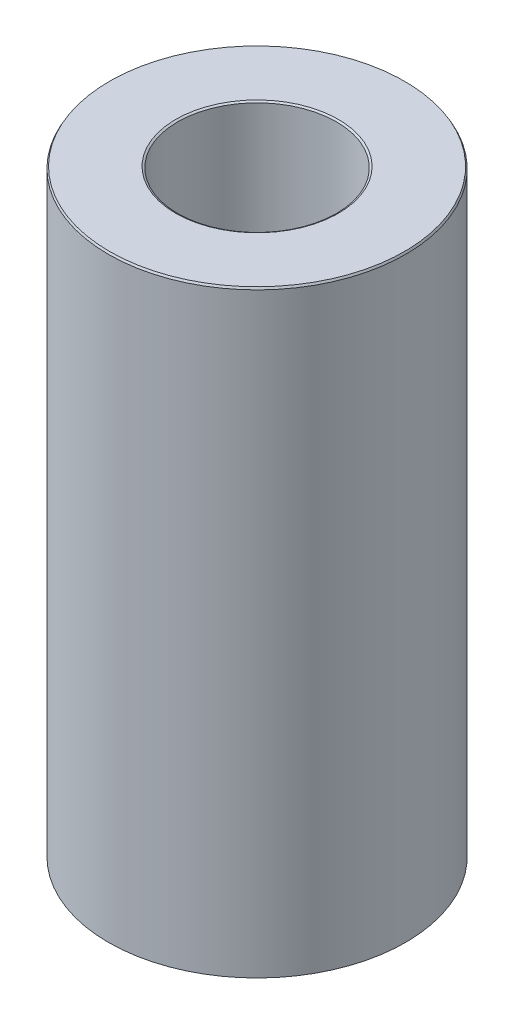
ISO-10303-21;
HEADER;
FILE_DESCRIPTION(('STEP AP214'),'2;1');
FILE_NAME('part.step','',(''),(''),'','','');
FILE_SCHEMA(('AUTOMOTIVE_DESIGN { 1 0 10303 214 1 1 1 1 }'));
ENDSEC;
DATA;
#1=APPLICATION_CONTEXT('core data for automotive mechanical design processes');
#2=APPLICATION_PROTOCOL_DEFINITION('international standard','automotive_design',2000,#1);
#3=PRODUCT_CONTEXT('',#1,'mechanical');
#4=PRODUCT('Part','Part','',(#3));
#5=PRODUCT_RELATED_PRODUCT_CATEGORY('part','',(#4));
#6=PRODUCT_DEFINITION_FORMATION('','',#4);
#7=PRODUCT_DEFINITION_CONTEXT('part definition',#1,'design');
#8=PRODUCT_DEFINITION('design','',#6,#7);
#9=PRODUCT_DEFINITION_SHAPE('','',#8);
#10=(LENGTH_UNIT() NAMED_UNIT(*) SI_UNIT(.MILLI.,.METRE.));
#11=(NAMED_UNIT(*) PLANE_ANGLE_UNIT() SI_UNIT($,.RADIAN.));
#12=(NAMED_UNIT(*) SI_UNIT($,.STERADIAN.) SOLID_ANGLE_UNIT());
#13=UNCERTAINTY_MEASURE_WITH_UNIT(LENGTH_MEASURE(1.E-05),#10,'distance_accuracy_value','');
#14=(GEOMETRIC_REPRESENTATION_CONTEXT(3) GLOBAL_UNCERTAINTY_ASSIGNED_CONTEXT((#13)) GLOBAL_UNIT_ASSIGNED_CONTEXT((#10,
#11,#12)) REPRESENTATION_CONTEXT('',''));
#15=CARTESIAN_POINT('',(0.,0.,0.));
#16=DIRECTION('',(0.,0.,1.));
#17=DIRECTION('',(1.,0.,0.));
#18=AXIS2_PLACEMENT_3D('',#15,#16,#17);
#19=CARTESIAN_POINT('',(0.,100.771122174254,0.));
#20=DIRECTION('',(0.,-1.,0.));
#21=DIRECTION('',(0.,0.,-1.));
#22=AXIS2_PLACEMENT_3D('',#19,#20,#21);
#23=CYLINDRICAL_SURFACE('',#22,25.);
#24=CARTESIAN_POINT('',(0.,0.188308871382908,0.));
#25=DIRECTION('',(0.,1.,0.));
#26=DIRECTION('',(0.,0.,1.));
#27=AXIS2_PLACEMENT_3D('',#24,#25,#26);
#28=CIRCLE('',#27,25.);
#29=CARTESIAN_POINT('',(0.,0.188308871382908,25.));
#30=VERTEX_POINT('',#29);
#31=EDGE_CURVE('E10',#30,#30,#28,.T.);
#32=ORIENTED_EDGE('',*,*,#31,.T.);
#33=EDGE_LOOP('',(#32));
#34=FACE_BOUND('',#33,.T.);
#35=CARTESIAN_POINT('',(0.,100.444961641503,0.));
#36=DIRECTION('',(0.,1.,0.));
#37=DIRECTION('',(0.,0.,1.));
#38=AXIS2_PLACEMENT_3D('',#35,#36,#37);
#39=CIRCLE('',#38,25.);
#40=CARTESIAN_POINT('',(0.,100.444961641503,25.));
#41=VERTEX_POINT('',#40);
#42=EDGE_CURVE('E50',#41,#41,#39,.F.);
#43=ORIENTED_EDGE('',*,*,#42,.T.);
#44=EDGE_LOOP('',(#43));
#45=FACE_BOUND('',#44,.T.);
#46=ADVANCED_FACE('F39',(#34,#45),#23,.T.);
#47=CARTESIAN_POINT('',(0.,100.771122174254,0.));
#48=DIRECTION('',(0.,1.,0.));
#49=DIRECTION('',(0.,0.,1.));
#50=AXIS2_PLACEMENT_3D('',#47,#48,#49);
#51=PLANE('',#50);
#52=CARTESIAN_POINT('',(0.,100.771122174254,0.));
#53=DIRECTION('',(0.,1.,0.));
#54=DIRECTION('',(0.,0.,1.));
#55=AXIS2_PLACEMENT_3D('',#52,#53,#54);
#56=CIRCLE('',#55,13.6873946291269);
#57=CARTESIAN_POINT('',(0.,100.771122174254,13.6873946291269));
#58=VERTEX_POINT('',#57);
#59=EDGE_CURVE('E58',#58,#58,#56,.F.);
#60=ORIENTED_EDGE('',*,*,#59,.T.);
#61=EDGE_LOOP('',(#60));
#62=FACE_BOUND('',#61,.T.);
#63=CARTESIAN_POINT('',(0.,100.771122174254,0.));
#64=DIRECTION('',(0.,1.,0.));
#65=DIRECTION('',(0.,0.,1.));
#66=AXIS2_PLACEMENT_3D('',#63,#64,#65);
#67=CIRCLE('',#66,24.8116911286171);
#68=CARTESIAN_POINT('',(0.,100.771122174254,24.8116911286171));
#69=VERTEX_POINT('',#68);
#70=EDGE_CURVE('E61',#69,#69,#67,.T.);
#71=ORIENTED_EDGE('',*,*,#70,.T.);
#72=EDGE_LOOP('',(#71));
#73=FACE_BOUND('',#72,.T.);
#74=ADVANCED_FACE('F88',(#62,#73),#51,.T.);
#75=CARTESIAN_POINT('',(0.,0.,0.));
#76=DIRECTION('',(0.,1.,0.));
#77=DIRECTION('',(0.,0.,1.));
#78=AXIS2_PLACEMENT_3D('',#75,#76,#77);
#79=PLANE('',#78);
#80=CARTESIAN_POINT('',(0.,0.,0.));
#81=DIRECTION('',(0.,1.,0.));
#82=DIRECTION('',(0.,0.,1.));
#83=AXIS2_PLACEMENT_3D('',#80,#81,#82);
#84=CIRCLE('',#83,13.5495429677587);
#85=CARTESIAN_POINT('',(0.,0.,13.5495429677587));
#86=VERTEX_POINT('',#85);
#87=EDGE_CURVE('E51',#86,#86,#84,.T.);
#88=ORIENTED_EDGE('',*,*,#87,.T.);
#89=EDGE_LOOP('',(#88));
#90=FACE_BOUND('',#89,.T.);
#91=CARTESIAN_POINT('',(0.,0.,0.));
#92=DIRECTION('',(0.,1.,0.));
#93=DIRECTION('',(0.,0.,1.));
#94=AXIS2_PLACEMENT_3D('',#91,#92,#93);
#95=CIRCLE('',#94,24.6738394672489);
#96=CARTESIAN_POINT('',(0.,0.,24.6738394672489));
#97=VERTEX_POINT('',#96);
#98=EDGE_CURVE('E54',#97,#97,#95,.F.);
#99=ORIENTED_EDGE('',*,*,#98,.T.);
#100=EDGE_LOOP('',(#99));
#101=FACE_BOUND('',#100,.T.);
#102=ADVANCED_FACE('F83',(#90,#101),#79,.F.);
#103=CARTESIAN_POINT('',(0.,100.771122174254,0.));
#104=DIRECTION('',(0.,-1.,0.));
#105=DIRECTION('',(0.,0.,-1.));
#106=AXIS2_PLACEMENT_3D('',#103,#104,#105);
#107=CYLINDRICAL_SURFACE('',#106,13.3612340963758);
#108=CARTESIAN_POINT('',(0.,100.582813302872,0.));
#109=DIRECTION('',(0.,1.,0.));
#110=DIRECTION('',(0.,0.,1.));
#111=AXIS2_PLACEMENT_3D('',#108,#109,#110);
#112=CIRCLE('',#111,13.3612340963758);
#113=CARTESIAN_POINT('',(0.,100.582813302872,13.3612340963758));
#114=VERTEX_POINT('',#113);
#115=EDGE_CURVE('E67',#114,#114,#112,.T.);
#116=ORIENTED_EDGE('',*,*,#115,.T.);
#117=EDGE_LOOP('',(#116));
#118=FACE_BOUND('',#117,.T.);
#119=CARTESIAN_POINT('',(0.,0.326160532751169,0.));
#120=DIRECTION('',(0.,1.,0.));
#121=DIRECTION('',(0.,0.,1.));
#122=AXIS2_PLACEMENT_3D('',#119,#120,#121);
#123=CIRCLE('',#122,13.3612340963758);
#124=CARTESIAN_POINT('',(0.,0.326160532751169,13.3612340963758));
#125=VERTEX_POINT('',#124);
#126=EDGE_CURVE('E69',#125,#125,#123,.F.);
#127=ORIENTED_EDGE('',*,*,#126,.T.);
#128=EDGE_LOOP('',(#127));
#129=FACE_BOUND('',#128,.T.);
#130=ADVANCED_FACE('F71',(#118,#129),#107,.F.);
#131=CARTESIAN_POINT('',(0.,100.582813302872,0.));
#132=DIRECTION('',(0.,1.,0.));
#133=DIRECTION('',(0.,0.,1.));
#134=AXIS2_PLACEMENT_3D('',#131,#132,#133);
#135=CONICAL_SURFACE('',#134,13.3612340963758,1.04719755119661);
#136=CARTESIAN_POINT('',(0.,100.771122174254,13.6873946291269));
#137=CARTESIAN_POINT('',(0.,100.769160623511,13.6839971235774));
#138=CARTESIAN_POINT('',(0.,100.767199072767,13.6805996180279));
#139=CARTESIAN_POINT('',(0.,100.76327597128,13.6738046069289));
#140=CARTESIAN_POINT('',(0.,100.761314420537,13.6704071013795));
#141=CARTESIAN_POINT('',(0.,100.757391319049,13.6636120902805));
#142=CARTESIAN_POINT('',(0.,100.755429768306,13.660214584731));
#143=CARTESIAN_POINT('',(0.,100.751506666819,13.653419573632));
#144=CARTESIAN_POINT('',(0.,100.749545116075,13.6500220680825));
#145=CARTESIAN_POINT('',(0.,100.745622014588,13.6432270569835));
#146=CARTESIAN_POINT('',(0.,100.743660463844,13.639829551434));
#147=CARTESIAN_POINT('',(0.,100.739737362357,13.6330345403351));
#148=CARTESIAN_POINT('',(0.,100.737775811614,13.6296370347856));
#149=CARTESIAN_POINT('',(0.,100.733852710127,13.6228420236866));
#150=CARTESIAN_POINT('',(0.,100.731891159383,13.6194445181371));
#151=CARTESIAN_POINT('',(0.,100.727968057896,13.6126495070381));
#152=CARTESIAN_POINT('',(0.,100.726006507152,13.6092520014886));
#153=CARTESIAN_POINT('',(0.,100.722083405665,13.6024569903896));
#154=CARTESIAN_POINT('',(0.,100.720121854922,13.5990594848401));
#155=CARTESIAN_POINT('',(0.,100.716198753434,13.5922644737412));
#156=CARTESIAN_POINT('',(0.,100.714237202691,13.5888669681917));
#157=CARTESIAN_POINT('',(0.,100.710314101204,13.5820719570927));
#158=CARTESIAN_POINT('',(0.,100.70835255046,13.5786744515432));
#159=CARTESIAN_POINT('',(0.,100.704429448973,13.5718794404442));
#160=CARTESIAN_POINT('',(0.,100.702467898229,13.5684819348947));
#161=CARTESIAN_POINT('',(0.,100.698544796742,13.5616869237957));
#162=CARTESIAN_POINT('',(0.,100.696583245999,13.5582894182463));
#163=CARTESIAN_POINT('',(0.,100.692660144512,13.5514944071473));
#164=CARTESIAN_POINT('',(0.,100.690698593768,13.5480969015978));
#165=CARTESIAN_POINT('',(0.,100.686775492281,13.5413018904988));
#166=CARTESIAN_POINT('',(0.,100.684813941537,13.5379043849493));
#167=CARTESIAN_POINT('',(0.,100.68089084005,13.5311093738503));
#168=CARTESIAN_POINT('',(0.,100.678929289307,13.5277118683008));
#169=CARTESIAN_POINT('',(0.,100.675006187819,13.5209168572019));
#170=CARTESIAN_POINT('',(0.,100.673044637076,13.5175193516524));
#171=CARTESIAN_POINT('',(0.,100.669121535589,13.5107243405534));
#172=CARTESIAN_POINT('',(0.,100.667159984845,13.5073268350039));
#173=CARTESIAN_POINT('',(0.,100.663236883358,13.5005318239049));
#174=CARTESIAN_POINT('',(0.,100.661275332614,13.4971343183554));
#175=CARTESIAN_POINT('',(0.,100.657352231127,13.4903393072564));
#176=CARTESIAN_POINT('',(0.,100.655390680384,13.4869418017069));
#177=CARTESIAN_POINT('',(0.,100.651467578897,13.480146790608));
#178=CARTESIAN_POINT('',(0.,100.649506028153,13.4767492850585));
#179=CARTESIAN_POINT('',(0.,100.645582926666,13.4699542739595));
#180=CARTESIAN_POINT('',(0.,100.643621375922,13.46655676841));
#181=CARTESIAN_POINT('',(0.,100.639698274435,13.459761757311));
#182=CARTESIAN_POINT('',(0.,100.637736723692,13.4563642517615));
#183=CARTESIAN_POINT('',(0.,100.633813622204,13.4495692406625));
#184=CARTESIAN_POINT('',(0.,100.631852071461,13.446171735113));
#185=CARTESIAN_POINT('',(0.,100.627928969974,13.4393767240141));
#186=CARTESIAN_POINT('',(0.,100.62596741923,13.4359792184646));
#187=CARTESIAN_POINT('',(0.,100.622044317743,13.4291842073656));
#188=CARTESIAN_POINT('',(0.,100.620082766999,13.4257867018161));
#189=CARTESIAN_POINT('',(0.,100.616159665512,13.4189916907171));
#190=CARTESIAN_POINT('',(0.,100.614198114769,13.4155941851676));
#191=CARTESIAN_POINT('',(0.,100.610275013282,13.4087991740686));
#192=CARTESIAN_POINT('',(0.,100.608313462538,13.4054016685192));
#193=CARTESIAN_POINT('',(0.,100.604390361051,13.3986066574202));
#194=CARTESIAN_POINT('',(0.,100.602428810307,13.3952091518707));
#195=CARTESIAN_POINT('',(0.,100.59850570882,13.3884141407717));
#196=CARTESIAN_POINT('',(0.,100.596544158077,13.3850166352222));
#197=CARTESIAN_POINT('',(0.,100.592621056589,13.3782216241232));
#198=CARTESIAN_POINT('',(0.,100.590659505846,13.3748241185737));
#199=CARTESIAN_POINT('',(0.,100.586736404359,13.3680291074748));
#200=CARTESIAN_POINT('',(0.,100.584774853615,13.3646316019253));
#201=CARTESIAN_POINT('',(0.,100.582813302872,13.3612340963758));
#202=B_SPLINE_CURVE_WITH_KNOTS('',3,(#136,#137,#138,#139,#140,#141,#142,#143,#144,#145,#146,
#147,#148,#149,#150,#151,#152,#153,#154,#155,#156,#157,#158,#159,#160,#161,#162,#163,#164,#165,
#166,#167,#168,#169,#170,#171,#172,#173,#174,#175,#176,#177,#178,#179,#180,#181,#182,#183,#184,
#185,#186,#187,#188,#189,#190,#191,#192,#193,#194,#195,#196,#197,#198,#199,#200,#201),
.UNSPECIFIED.,.F.,.F.,(4,2,2,2,2,2,2,2,2,2,2,2,2,2,2,2,2,2,2,2,2,2,2,2,2,2,2,2,2,2,2,2,4),(0.,
0.0117693044614293,0.0235386089228587,0.035307913384288,0.0470772178457243,0.0588465223071537,
0.070615826768583,0.0823851312300109,0.0941544356914472,0.105923740152877,0.117693044614306,
0.129462349075742,0.141231653537171,0.153000957998601,0.16477026246003,0.176539566921466,
0.188308871382896,0.200078175844325,0.211847480305761,0.223616784767191,0.23538608922862,
0.247155393690049,0.258924698151486,0.270694002612913,0.282463307074343,0.294232611535779,
0.306001915997208,0.317771220458638,0.329540524920067,0.341309829381503,0.353079133842933,
0.364848438304362,0.376617742765791),.UNSPECIFIED.);
#203=EDGE_CURVE('BSEAM77',#58,#114,#202,.T.);
#204=ORIENTED_EDGE('',*,*,#59,.F.);
#205=ORIENTED_EDGE('',*,*,#115,.F.);
#206=ORIENTED_EDGE('',*,*,#203,.T.);
#207=ORIENTED_EDGE('',*,*,#203,.F.);
#208=EDGE_LOOP('',(#204,#206,#205,#207));
#209=FACE_BOUND('',#208,.T.);
#210=ADVANCED_FACE('F77',(#209),#135,.F.);
#211=CARTESIAN_POINT('',(0.,0.,0.));
#212=DIRECTION('',(0.,-1.,0.));
#213=DIRECTION('',(0.,0.,-1.));
#214=AXIS2_PLACEMENT_3D('',#211,#212,#213);
#215=CONICAL_SURFACE('',#214,13.5495429677587,0.523598775598299);
#216=ORIENTED_EDGE('',*,*,#126,.F.);
#217=EDGE_LOOP('',(#216));
#218=FACE_BOUND('',#217,.T.);
#219=ORIENTED_EDGE('',*,*,#87,.F.);
#220=EDGE_LOOP('',(#219));
#221=FACE_BOUND('',#220,.T.);
#222=ADVANCED_FACE('F73',(#218,#221),#215,.F.);
#223=CARTESIAN_POINT('',(0.,0.188308871382908,0.));
#224=DIRECTION('',(0.,1.,0.));
#225=DIRECTION('',(0.,0.,1.));
#226=AXIS2_PLACEMENT_3D('',#223,#224,#225);
#227=CONICAL_SURFACE('',#226,25.,1.04719755119659);
#228=ORIENTED_EDGE('',*,*,#98,.F.);
#229=EDGE_LOOP('',(#228));
#230=FACE_BOUND('',#229,.T.);
#231=ORIENTED_EDGE('',*,*,#31,.F.);
#232=EDGE_LOOP('',(#231));
#233=FACE_BOUND('',#232,.T.);
#234=ADVANCED_FACE('F76',(#230,#233),#227,.T.);
#235=CARTESIAN_POINT('',(0.,100.771122174254,0.));
#236=DIRECTION('',(0.,-1.,0.));
#237=DIRECTION('',(0.,0.,-1.));
#238=AXIS2_PLACEMENT_3D('',#235,#236,#237);
#239=CONICAL_SURFACE('',#238,24.8116911286171,0.523598775598297);
#240=ORIENTED_EDGE('',*,*,#42,.F.);
#241=EDGE_LOOP('',(#240));
#242=FACE_BOUND('',#241,.T.);
#243=ORIENTED_EDGE('',*,*,#70,.F.);
#244=EDGE_LOOP('',(#243));
#245=FACE_BOUND('',#244,.T.);
#246=ADVANCED_FACE('F45',(#242,#245),#239,.T.);
#247=CLOSED_SHELL('',(#46,#74,#102,#130,#210,#222,#234,#246));
#248=MANIFOLD_SOLID_BREP('B2',#247);
#249=ADVANCED_BREP_SHAPE_REPRESENTATION('',(#18,#248),#14);
#250=SHAPE_DEFINITION_REPRESENTATION(#9,#249);
ENDSEC;
END-ISO-10303-21;
